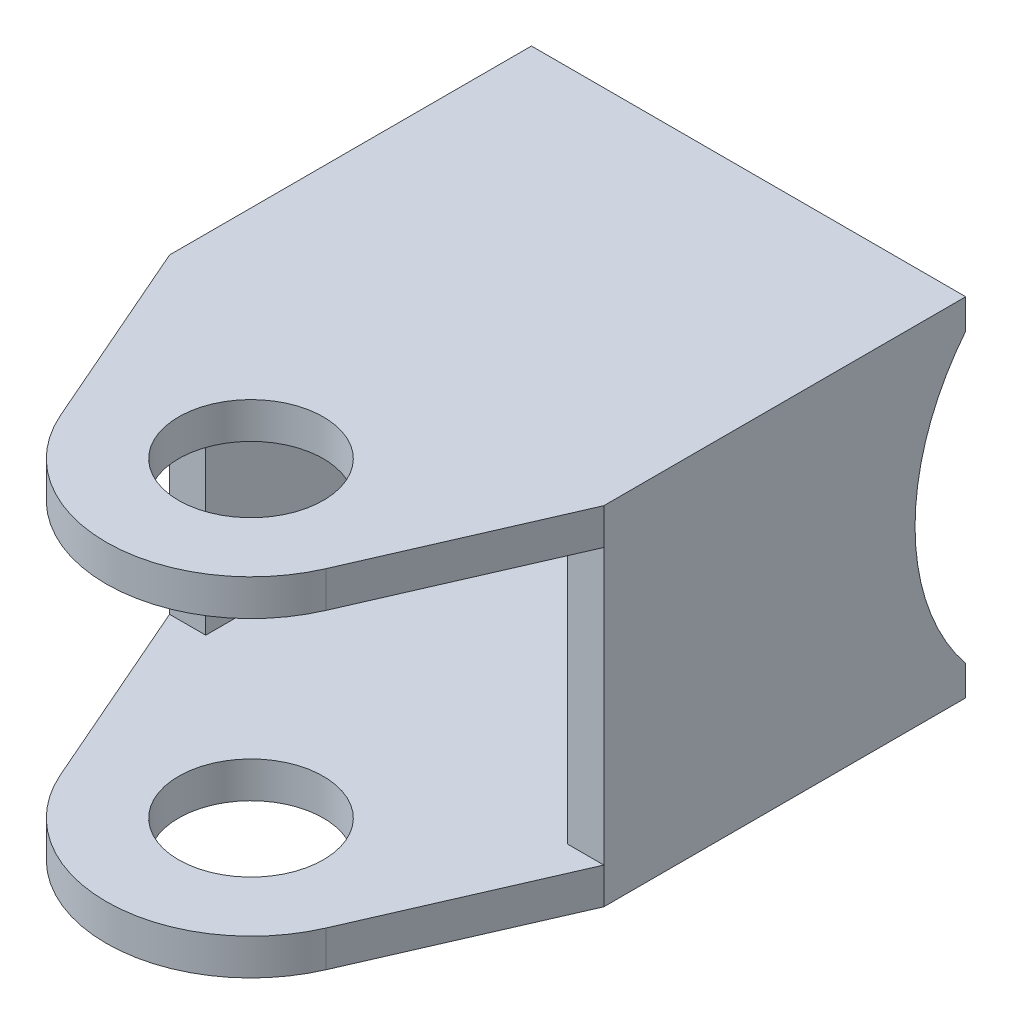
ISO-10303-21;
HEADER;
FILE_DESCRIPTION(('STEP AP214'),'2;1');
FILE_NAME('part.step','',(''),(''),'','','');
FILE_SCHEMA(('AUTOMOTIVE_DESIGN { 1 0 10303 214 1 1 1 1 }'));
ENDSEC;
DATA;
#1=APPLICATION_CONTEXT('core data for automotive mechanical design processes');
#2=APPLICATION_PROTOCOL_DEFINITION('international standard','automotive_design',2000,#1);
#3=PRODUCT_CONTEXT('',#1,'mechanical');
#4=PRODUCT('Part','Part','',(#3));
#5=PRODUCT_RELATED_PRODUCT_CATEGORY('part','',(#4));
#6=PRODUCT_DEFINITION_FORMATION('','',#4);
#7=PRODUCT_DEFINITION_CONTEXT('part definition',#1,'design');
#8=PRODUCT_DEFINITION('design','',#6,#7);
#9=PRODUCT_DEFINITION_SHAPE('','',#8);
#10=(LENGTH_UNIT() NAMED_UNIT(*) SI_UNIT(.MILLI.,.METRE.));
#11=(NAMED_UNIT(*) PLANE_ANGLE_UNIT() SI_UNIT($,.RADIAN.));
#12=(NAMED_UNIT(*) SI_UNIT($,.STERADIAN.) SOLID_ANGLE_UNIT());
#13=UNCERTAINTY_MEASURE_WITH_UNIT(LENGTH_MEASURE(1.E-05),#10,'distance_accuracy_value','');
#14=(GEOMETRIC_REPRESENTATION_CONTEXT(3) GLOBAL_UNCERTAINTY_ASSIGNED_CONTEXT((#13)) GLOBAL_UNIT_ASSIGNED_CONTEXT((#10,
#11,#12)) REPRESENTATION_CONTEXT('',''));
#15=CARTESIAN_POINT('',(0.,0.,0.));
#16=DIRECTION('',(0.,0.,1.));
#17=DIRECTION('',(1.,0.,0.));
#18=AXIS2_PLACEMENT_3D('',#15,#16,#17);
#19=CARTESIAN_POINT('',(0.,7.6,0.));
#20=DIRECTION('',(0.,-1.,0.));
#21=DIRECTION('',(0.,0.,-1.));
#22=AXIS2_PLACEMENT_3D('',#19,#20,#21);
#23=PLANE('',#22);
#24=CARTESIAN_POINT('',(0.,7.6,0.));
#25=DIRECTION('',(0.,1.,0.));
#26=DIRECTION('',(0.,0.,1.));
#27=AXIS2_PLACEMENT_3D('',#24,#25,#26);
#28=CIRCLE('',#27,4.);
#29=CARTESIAN_POINT('',(0.,7.6,4.));
#30=VERTEX_POINT('',#29);
#31=EDGE_CURVE('E185',#30,#30,#28,.T.);
#32=ORIENTED_EDGE('',*,*,#31,.T.);
#33=EDGE_LOOP('',(#32));
#34=FACE_BOUND('',#33,.T.);
#35=DIRECTION('',(0.,0.,1.));
#36=VECTOR('',#35,1.);
#37=CARTESIAN_POINT('',(-10.,7.6,-27.5));
#38=LINE('',#37,#36);
#39=CARTESIAN_POINT('',(-10.,7.6,-27.2250307125771));
#40=VERTEX_POINT('',#39);
#41=CARTESIAN_POINT('',(-10.,7.6,-7.5));
#42=VERTEX_POINT('',#41);
#43=EDGE_CURVE('E38',#40,#42,#38,.T.);
#44=ORIENTED_EDGE('',*,*,#43,.F.);
#45=DIRECTION('',(-1.,0.,0.));
#46=VECTOR('',#45,1.);
#47=CARTESIAN_POINT('',(12.,7.6,-27.2250307125771));
#48=LINE('',#47,#46);
#49=CARTESIAN_POINT('',(10.,7.6,-27.2250307125771));
#50=VERTEX_POINT('',#49);
#51=EDGE_CURVE('E379',#40,#50,#48,.F.);
#52=ORIENTED_EDGE('',*,*,#51,.T.);
#53=DIRECTION('',(0.,0.,-1.));
#54=VECTOR('',#53,1.);
#55=CARTESIAN_POINT('',(10.,7.6,-27.5));
#56=LINE('',#55,#54);
#57=CARTESIAN_POINT('',(10.,7.6,-7.5));
#58=VERTEX_POINT('',#57);
#59=EDGE_CURVE('E256',#58,#50,#56,.T.);
#60=ORIENTED_EDGE('',*,*,#59,.F.);
#61=DIRECTION('',(-1.,0.,0.));
#62=VECTOR('',#61,1.);
#63=CARTESIAN_POINT('',(12.,7.6,-7.5));
#64=LINE('',#63,#62);
#65=CARTESIAN_POINT('',(12.,7.6,-7.5));
#66=VERTEX_POINT('',#65);
#67=EDGE_CURVE('E253',#66,#58,#64,.T.);
#68=ORIENTED_EDGE('',*,*,#67,.F.);
#69=DIRECTION('',(0.399857230257902,0.,-0.916577435577856));
#70=VECTOR('',#69,1.);
#71=CARTESIAN_POINT('',(12.,7.6,-7.5));
#72=LINE('',#71,#70);
#73=CARTESIAN_POINT('',(7.33261948462285,7.6,3.19885784206322));
#74=VERTEX_POINT('',#73);
#75=EDGE_CURVE('E199',#74,#66,#72,.T.);
#76=ORIENTED_EDGE('',*,*,#75,.F.);
#77=CARTESIAN_POINT('',(0.,7.6,0.));
#78=DIRECTION('',(0.,1.,0.));
#79=DIRECTION('',(0.,0.,-1.));
#80=AXIS2_PLACEMENT_3D('',#77,#78,#79);
#81=CIRCLE('',#80,8.);
#82=CARTESIAN_POINT('',(-7.33261948462285,7.6,3.19885784206322));
#83=VERTEX_POINT('',#82);
#84=EDGE_CURVE('E211',#83,#74,#81,.T.);
#85=ORIENTED_EDGE('',*,*,#84,.F.);
#86=DIRECTION('',(0.399857230257903,0.,0.916577435577856));
#87=VECTOR('',#86,1.);
#88=CARTESIAN_POINT('',(-12.,7.6,-7.5));
#89=LINE('',#88,#87);
#90=CARTESIAN_POINT('',(-12.,7.6,-7.5));
#91=VERTEX_POINT('',#90);
#92=EDGE_CURVE('E194',#91,#83,#89,.T.);
#93=ORIENTED_EDGE('',*,*,#92,.F.);
#94=DIRECTION('',(-1.,0.,0.));
#95=VECTOR('',#94,1.);
#96=CARTESIAN_POINT('',(-12.,7.6,-7.5));
#97=LINE('',#96,#95);
#98=EDGE_CURVE('E182',#42,#91,#97,.T.);
#99=ORIENTED_EDGE('',*,*,#98,.F.);
#100=EDGE_LOOP('',(#44,#52,#60,#68,#76,#85,#93,#99));
#101=FACE_BOUND('',#100,.T.);
#102=ADVANCED_FACE('F34',(#34,#101),#23,.T.);
#103=CARTESIAN_POINT('',(0.,-7.6,0.));
#104=DIRECTION('',(0.,-1.,0.));
#105=DIRECTION('',(0.,0.,-1.));
#106=AXIS2_PLACEMENT_3D('',#103,#104,#105);
#107=PLANE('',#106);
#108=CARTESIAN_POINT('',(0.,-7.6,0.));
#109=DIRECTION('',(0.,1.,0.));
#110=DIRECTION('',(0.,0.,1.));
#111=AXIS2_PLACEMENT_3D('',#108,#109,#110);
#112=CIRCLE('',#111,4.);
#113=CARTESIAN_POINT('',(0.,-7.6,4.));
#114=VERTEX_POINT('',#113);
#115=EDGE_CURVE('E261',#114,#114,#112,.T.);
#116=ORIENTED_EDGE('',*,*,#115,.F.);
#117=EDGE_LOOP('',(#116));
#118=FACE_BOUND('',#117,.T.);
#119=DIRECTION('',(-1.,0.,0.));
#120=VECTOR('',#119,1.);
#121=CARTESIAN_POINT('',(12.,-7.6,-27.2250307125771));
#122=LINE('',#121,#120);
#123=CARTESIAN_POINT('',(-10.,-7.6,-27.2250307125771));
#124=VERTEX_POINT('',#123);
#125=CARTESIAN_POINT('',(10.,-7.6,-27.2250307125771));
#126=VERTEX_POINT('',#125);
#127=EDGE_CURVE('E58',#124,#126,#122,.F.);
#128=ORIENTED_EDGE('',*,*,#127,.F.);
#129=DIRECTION('',(0.,0.,-1.));
#130=VECTOR('',#129,1.);
#131=CARTESIAN_POINT('',(-10.,-7.6,-27.5));
#132=LINE('',#131,#130);
#133=CARTESIAN_POINT('',(-10.,-7.6,-7.5));
#134=VERTEX_POINT('',#133);
#135=EDGE_CURVE('E173',#134,#124,#132,.T.);
#136=ORIENTED_EDGE('',*,*,#135,.F.);
#137=DIRECTION('',(1.,0.,0.));
#138=VECTOR('',#137,1.);
#139=CARTESIAN_POINT('',(-12.,-7.6,-7.5));
#140=LINE('',#139,#138);
#141=CARTESIAN_POINT('',(-12.,-7.6,-7.5));
#142=VERTEX_POINT('',#141);
#143=EDGE_CURVE('E177',#142,#134,#140,.T.);
#144=ORIENTED_EDGE('',*,*,#143,.F.);
#145=DIRECTION('',(0.399857230257903,0.,0.916577435577856));
#146=VECTOR('',#145,1.);
#147=CARTESIAN_POINT('',(-12.,-7.6,-7.5));
#148=LINE('',#147,#146);
#149=CARTESIAN_POINT('',(-7.33261948462285,-7.6,3.19885784206322));
#150=VERTEX_POINT('',#149);
#151=EDGE_CURVE('E269',#142,#150,#148,.T.);
#152=ORIENTED_EDGE('',*,*,#151,.T.);
#153=CARTESIAN_POINT('',(0.,-7.6,0.));
#154=DIRECTION('',(0.,1.,0.));
#155=DIRECTION('',(0.,0.,-1.));
#156=AXIS2_PLACEMENT_3D('',#153,#154,#155);
#157=CIRCLE('',#156,8.);
#158=CARTESIAN_POINT('',(7.33261948462285,-7.6,3.19885784206322));
#159=VERTEX_POINT('',#158);
#160=EDGE_CURVE('E291',#150,#159,#157,.T.);
#161=ORIENTED_EDGE('',*,*,#160,.T.);
#162=DIRECTION('',(0.399857230257902,0.,-0.916577435577856));
#163=VECTOR('',#162,1.);
#164=CARTESIAN_POINT('',(12.,-7.6,-7.5));
#165=LINE('',#164,#163);
#166=CARTESIAN_POINT('',(12.,-7.6,-7.5));
#167=VERTEX_POINT('',#166);
#168=EDGE_CURVE('E275',#159,#167,#165,.T.);
#169=ORIENTED_EDGE('',*,*,#168,.T.);
#170=DIRECTION('',(1.,0.,0.));
#171=VECTOR('',#170,1.);
#172=CARTESIAN_POINT('',(12.,-7.6,-7.5));
#173=LINE('',#172,#171);
#174=CARTESIAN_POINT('',(10.,-7.6,-7.5));
#175=VERTEX_POINT('',#174);
#176=EDGE_CURVE('E388',#175,#167,#173,.T.);
#177=ORIENTED_EDGE('',*,*,#176,.F.);
#178=DIRECTION('',(0.,0.,1.));
#179=VECTOR('',#178,1.);
#180=CARTESIAN_POINT('',(10.,-7.6,-27.5));
#181=LINE('',#180,#179);
#182=EDGE_CURVE('E155',#126,#175,#181,.T.);
#183=ORIENTED_EDGE('',*,*,#182,.F.);
#184=EDGE_LOOP('',(#128,#136,#144,#152,#161,#169,#177,#183));
#185=FACE_BOUND('',#184,.T.);
#186=ADVANCED_FACE('F329',(#118,#185),#107,.F.);
#187=CARTESIAN_POINT('',(12.,9.6,-27.5));
#188=DIRECTION('',(-1.,0.,0.));
#189=DIRECTION('',(0.,0.,1.));
#190=AXIS2_PLACEMENT_3D('',#187,#188,#189);
#191=PLANE('',#190);
#192=CARTESIAN_POINT('',(12.,0.,-37.4));
#193=DIRECTION('',(1.,0.,0.));
#194=DIRECTION('',(0.,0.,-1.));
#195=AXIS2_PLACEMENT_3D('',#192,#193,#194);
#196=CIRCLE('',#195,12.7);
#197=CARTESIAN_POINT('',(12.,7.95487272054054,-27.5));
#198=VERTEX_POINT('',#197);
#199=CARTESIAN_POINT('',(12.,-7.95487272054054,-27.5));
#200=VERTEX_POINT('',#199);
#201=EDGE_CURVE('E149',#198,#200,#196,.T.);
#202=ORIENTED_EDGE('',*,*,#201,.F.);
#203=DIRECTION('',(0.,-1.,0.));
#204=VECTOR('',#203,1.);
#205=CARTESIAN_POINT('',(12.,9.6,-27.5));
#206=LINE('',#205,#204);
#207=CARTESIAN_POINT('',(12.,9.6,-27.5));
#208=VERTEX_POINT('',#207);
#209=EDGE_CURVE('E44',#208,#198,#206,.T.);
#210=ORIENTED_EDGE('',*,*,#209,.F.);
#211=DIRECTION('',(0.,0.,-1.));
#212=VECTOR('',#211,1.);
#213=CARTESIAN_POINT('',(12.,9.6,-27.5));
#214=LINE('',#213,#212);
#215=CARTESIAN_POINT('',(12.,9.6,-7.5));
#216=VERTEX_POINT('',#215);
#217=EDGE_CURVE('E197',#216,#208,#214,.T.);
#218=ORIENTED_EDGE('',*,*,#217,.F.);
#219=DIRECTION('',(0.,-1.,0.));
#220=VECTOR('',#219,1.);
#221=CARTESIAN_POINT('',(12.,9.6,-7.5));
#222=LINE('',#221,#220);
#223=EDGE_CURVE('E209',#216,#66,#222,.T.);
#224=ORIENTED_EDGE('',*,*,#223,.T.);
#225=DIRECTION('',(0.,-1.,0.));
#226=VECTOR('',#225,1.);
#227=CARTESIAN_POINT('',(12.,27.6997512422418,-7.5));
#228=LINE('',#227,#226);
#229=EDGE_CURVE('E241',#66,#167,#228,.T.);
#230=ORIENTED_EDGE('',*,*,#229,.T.);
#231=DIRECTION('',(0.,1.,0.));
#232=VECTOR('',#231,1.);
#233=CARTESIAN_POINT('',(12.,-9.6,-7.5));
#234=LINE('',#233,#232);
#235=CARTESIAN_POINT('',(12.,-9.6,-7.5));
#236=VERTEX_POINT('',#235);
#237=EDGE_CURVE('E296',#236,#167,#234,.T.);
#238=ORIENTED_EDGE('',*,*,#237,.F.);
#239=DIRECTION('',(0.,0.,-1.));
#240=VECTOR('',#239,1.);
#241=CARTESIAN_POINT('',(12.,-9.6,-27.5));
#242=LINE('',#241,#240);
#243=CARTESIAN_POINT('',(12.,-9.6,-27.5));
#244=VERTEX_POINT('',#243);
#245=EDGE_CURVE('E272',#236,#244,#242,.T.);
#246=ORIENTED_EDGE('',*,*,#245,.T.);
#247=EDGE_CURVE('E162',#200,#244,#206,.T.);
#248=ORIENTED_EDGE('',*,*,#247,.F.);
#249=EDGE_LOOP('',(#202,#210,#218,#224,#230,#238,#246,#248));
#250=FACE_BOUND('',#249,.T.);
#251=ADVANCED_FACE('F36',(#250),#191,.F.);
#252=CARTESIAN_POINT('',(7.06,9.6,-27.5));
#253=DIRECTION('',(0.,0.,1.));
#254=DIRECTION('',(1.,0.,0.));
#255=AXIS2_PLACEMENT_3D('',#252,#253,#254);
#256=PLANE('',#255);
#257=DIRECTION('',(-1.,0.,0.));
#258=VECTOR('',#257,1.);
#259=CARTESIAN_POINT('',(12.,7.95487272054054,-27.5));
#260=LINE('',#259,#258);
#261=CARTESIAN_POINT('',(-12.,7.95487272054054,-27.5));
#262=VERTEX_POINT('',#261);
#263=EDGE_CURVE('E146',#262,#198,#260,.F.);
#264=ORIENTED_EDGE('',*,*,#263,.F.);
#265=DIRECTION('',(0.,-1.,0.));
#266=VECTOR('',#265,1.);
#267=CARTESIAN_POINT('',(-12.,9.6,-27.5));
#268=LINE('',#267,#266);
#269=CARTESIAN_POINT('',(-12.,9.6,-27.5));
#270=VERTEX_POINT('',#269);
#271=EDGE_CURVE('E168',#270,#262,#268,.T.);
#272=ORIENTED_EDGE('',*,*,#271,.F.);
#273=DIRECTION('',(-1.,0.,0.));
#274=VECTOR('',#273,1.);
#275=CARTESIAN_POINT('',(7.06,9.6,-27.5));
#276=LINE('',#275,#274);
#277=EDGE_CURVE('E165',#208,#270,#276,.T.);
#278=ORIENTED_EDGE('',*,*,#277,.F.);
#279=ORIENTED_EDGE('',*,*,#209,.T.);
#280=EDGE_LOOP('',(#264,#272,#278,#279));
#281=FACE_BOUND('',#280,.T.);
#282=ADVANCED_FACE('F164',(#281),#256,.F.);
#283=DIRECTION('',(-1.,0.,0.));
#284=VECTOR('',#283,1.);
#285=CARTESIAN_POINT('',(12.,-7.95487272054054,-27.5));
#286=LINE('',#285,#284);
#287=CARTESIAN_POINT('',(-12.,-7.95487272054054,-27.5));
#288=VERTEX_POINT('',#287);
#289=EDGE_CURVE('E51',#200,#288,#286,.T.);
#290=ORIENTED_EDGE('',*,*,#289,.F.);
#291=ORIENTED_EDGE('',*,*,#247,.T.);
#292=DIRECTION('',(-1.,0.,0.));
#293=VECTOR('',#292,1.);
#294=CARTESIAN_POINT('',(7.06,-9.6,-27.5));
#295=LINE('',#294,#293);
#296=CARTESIAN_POINT('',(-12.,-9.6,-27.5));
#297=VERTEX_POINT('',#296);
#298=EDGE_CURVE('E274',#244,#297,#295,.T.);
#299=ORIENTED_EDGE('',*,*,#298,.T.);
#300=EDGE_CURVE('E223',#288,#297,#268,.T.);
#301=ORIENTED_EDGE('',*,*,#300,.F.);
#302=EDGE_LOOP('',(#290,#291,#299,#301));
#303=FACE_BOUND('',#302,.T.);
#304=ADVANCED_FACE('F397',(#303),#256,.F.);
#305=CARTESIAN_POINT('',(-12.,9.6,-22.8889007140539));
#306=DIRECTION('',(1.,0.,0.));
#307=DIRECTION('',(0.,0.,-1.));
#308=AXIS2_PLACEMENT_3D('',#305,#306,#307);
#309=PLANE('',#308);
#310=CARTESIAN_POINT('',(-12.,0.,-37.4));
#311=DIRECTION('',(1.,0.,0.));
#312=DIRECTION('',(0.,0.,-1.));
#313=AXIS2_PLACEMENT_3D('',#310,#311,#312);
#314=CIRCLE('',#313,12.7);
#315=EDGE_CURVE('E150',#262,#288,#314,.T.);
#316=ORIENTED_EDGE('',*,*,#315,.T.);
#317=ORIENTED_EDGE('',*,*,#300,.T.);
#318=DIRECTION('',(0.,0.,1.));
#319=VECTOR('',#318,1.);
#320=CARTESIAN_POINT('',(-12.,-9.6,-27.5));
#321=LINE('',#320,#319);
#322=CARTESIAN_POINT('',(-12.,-9.6,-7.5));
#323=VERTEX_POINT('',#322);
#324=EDGE_CURVE('E277',#297,#323,#321,.T.);
#325=ORIENTED_EDGE('',*,*,#324,.T.);
#326=DIRECTION('',(0.,1.,0.));
#327=VECTOR('',#326,1.);
#328=CARTESIAN_POINT('',(-12.,-9.6,-7.5));
#329=LINE('',#328,#327);
#330=EDGE_CURVE('E288',#323,#142,#329,.T.);
#331=ORIENTED_EDGE('',*,*,#330,.T.);
#332=DIRECTION('',(0.,-1.,0.));
#333=VECTOR('',#332,1.);
#334=CARTESIAN_POINT('',(-12.,27.6997512422418,-7.5));
#335=LINE('',#334,#333);
#336=EDGE_CURVE('E188',#91,#142,#335,.T.);
#337=ORIENTED_EDGE('',*,*,#336,.F.);
#338=DIRECTION('',(0.,-1.,0.));
#339=VECTOR('',#338,1.);
#340=CARTESIAN_POINT('',(-12.,9.6,-7.5));
#341=LINE('',#340,#339);
#342=CARTESIAN_POINT('',(-12.,9.6,-7.5));
#343=VERTEX_POINT('',#342);
#344=EDGE_CURVE('E222',#343,#91,#341,.T.);
#345=ORIENTED_EDGE('',*,*,#344,.F.);
#346=DIRECTION('',(0.,0.,1.));
#347=VECTOR('',#346,1.);
#348=CARTESIAN_POINT('',(-12.,9.6,-27.5));
#349=LINE('',#348,#347);
#350=EDGE_CURVE('E201',#270,#343,#349,.T.);
#351=ORIENTED_EDGE('',*,*,#350,.F.);
#352=ORIENTED_EDGE('',*,*,#271,.T.);
#353=EDGE_LOOP('',(#316,#317,#325,#331,#337,#345,#351,#352));
#354=FACE_BOUND('',#353,.T.);
#355=ADVANCED_FACE('F232',(#354),#309,.F.);
#356=CARTESIAN_POINT('',(-10.,27.6997512422418,-27.5));
#357=DIRECTION('',(-1.,0.,0.));
#358=DIRECTION('',(0.,0.,1.));
#359=AXIS2_PLACEMENT_3D('',#356,#357,#358);
#360=PLANE('',#359);
#361=CARTESIAN_POINT('',(-10.,0.,-37.4));
#362=DIRECTION('',(-1.,0.,0.));
#363=DIRECTION('',(0.,0.,1.));
#364=AXIS2_PLACEMENT_3D('',#361,#362,#363);
#365=CIRCLE('',#364,12.7);
#366=EDGE_CURVE('E378',#40,#124,#365,.F.);
#367=ORIENTED_EDGE('',*,*,#366,.F.);
#368=ORIENTED_EDGE('',*,*,#43,.T.);
#369=DIRECTION('',(0.,-1.,0.));
#370=VECTOR('',#369,1.);
#371=CARTESIAN_POINT('',(-10.,27.6997512422418,-7.5));
#372=LINE('',#371,#370);
#373=EDGE_CURVE('E176',#42,#134,#372,.T.);
#374=ORIENTED_EDGE('',*,*,#373,.T.);
#375=ORIENTED_EDGE('',*,*,#135,.T.);
#376=EDGE_LOOP('',(#367,#368,#374,#375));
#377=FACE_BOUND('',#376,.T.);
#378=ADVANCED_FACE('F347',(#377),#360,.F.);
#379=CARTESIAN_POINT('',(10.,27.6997512422418,-27.5));
#380=DIRECTION('',(1.,0.,0.));
#381=DIRECTION('',(0.,0.,-1.));
#382=AXIS2_PLACEMENT_3D('',#379,#380,#381);
#383=PLANE('',#382);
#384=CARTESIAN_POINT('',(10.,0.,-37.4));
#385=DIRECTION('',(1.,0.,0.));
#386=DIRECTION('',(0.,0.,-1.));
#387=AXIS2_PLACEMENT_3D('',#384,#385,#386);
#388=CIRCLE('',#387,12.7);
#389=EDGE_CURVE('E11',#126,#50,#388,.F.);
#390=ORIENTED_EDGE('',*,*,#389,.F.);
#391=ORIENTED_EDGE('',*,*,#182,.T.);
#392=DIRECTION('',(0.,-1.,0.));
#393=VECTOR('',#392,1.);
#394=CARTESIAN_POINT('',(10.,27.6997512422418,-7.5));
#395=LINE('',#394,#393);
#396=EDGE_CURVE('E259',#58,#175,#395,.T.);
#397=ORIENTED_EDGE('',*,*,#396,.F.);
#398=ORIENTED_EDGE('',*,*,#59,.T.);
#399=EDGE_LOOP('',(#390,#391,#397,#398));
#400=FACE_BOUND('',#399,.T.);
#401=ADVANCED_FACE('F340',(#400),#383,.F.);
#402=CARTESIAN_POINT('',(0.,9.6,0.));
#403=DIRECTION('',(0.,-1.,0.));
#404=DIRECTION('',(0.,0.,-1.));
#405=AXIS2_PLACEMENT_3D('',#402,#403,#404);
#406=PLANE('',#405);
#407=ORIENTED_EDGE('',*,*,#217,.T.);
#408=ORIENTED_EDGE('',*,*,#277,.T.);
#409=ORIENTED_EDGE('',*,*,#350,.T.);
#410=DIRECTION('',(0.399857230257903,0.,0.916577435577856));
#411=VECTOR('',#410,1.);
#412=CARTESIAN_POINT('',(-12.,9.6,-7.5));
#413=LINE('',#412,#411);
#414=CARTESIAN_POINT('',(-7.33261948462285,9.6,3.19885784206322));
#415=VERTEX_POINT('',#414);
#416=EDGE_CURVE('E203',#343,#415,#413,.T.);
#417=ORIENTED_EDGE('',*,*,#416,.T.);
#418=CARTESIAN_POINT('',(0.,9.6,0.));
#419=DIRECTION('',(0.,1.,0.));
#420=DIRECTION('',(0.,0.,-1.));
#421=AXIS2_PLACEMENT_3D('',#418,#419,#420);
#422=CIRCLE('',#421,8.);
#423=CARTESIAN_POINT('',(7.33261948462285,9.6,3.19885784206322));
#424=VERTEX_POINT('',#423);
#425=EDGE_CURVE('E205',#415,#424,#422,.T.);
#426=ORIENTED_EDGE('',*,*,#425,.T.);
#427=DIRECTION('',(0.399857230257902,0.,-0.916577435577856));
#428=VECTOR('',#427,1.);
#429=CARTESIAN_POINT('',(12.,9.6,-7.5));
#430=LINE('',#429,#428);
#431=EDGE_CURVE('E207',#424,#216,#430,.T.);
#432=ORIENTED_EDGE('',*,*,#431,.T.);
#433=EDGE_LOOP('',(#407,#408,#409,#417,#426,#432));
#434=FACE_BOUND('',#433,.T.);
#435=CARTESIAN_POINT('',(0.,9.6,0.));
#436=DIRECTION('',(0.,1.,0.));
#437=DIRECTION('',(0.,0.,1.));
#438=AXIS2_PLACEMENT_3D('',#435,#436,#437);
#439=CIRCLE('',#438,4.);
#440=CARTESIAN_POINT('',(0.,9.6,4.));
#441=VERTEX_POINT('',#440);
#442=EDGE_CURVE('E191',#441,#441,#439,.T.);
#443=ORIENTED_EDGE('',*,*,#442,.F.);
#444=EDGE_LOOP('',(#443));
#445=FACE_BOUND('',#444,.T.);
#446=ADVANCED_FACE('F235',(#434,#445),#406,.F.);
#447=CARTESIAN_POINT('',(-12.,9.6,-7.5));
#448=DIRECTION('',(0.916577435577856,0.,-0.399857230257903));
#449=DIRECTION('',(-0.399857230257903,0.,-0.916577435577856));
#450=AXIS2_PLACEMENT_3D('',#447,#448,#449);
#451=PLANE('',#450);
#452=ORIENTED_EDGE('',*,*,#92,.T.);
#453=DIRECTION('',(0.,-1.,0.));
#454=VECTOR('',#453,1.);
#455=CARTESIAN_POINT('',(-7.33261948462285,9.6,3.19885784206322));
#456=LINE('',#455,#454);
#457=EDGE_CURVE('E220',#415,#83,#456,.T.);
#458=ORIENTED_EDGE('',*,*,#457,.F.);
#459=ORIENTED_EDGE('',*,*,#416,.F.);
#460=ORIENTED_EDGE('',*,*,#344,.T.);
#461=EDGE_LOOP('',(#452,#458,#459,#460));
#462=FACE_BOUND('',#461,.T.);
#463=ADVANCED_FACE('F315',(#462),#451,.F.);
#464=CARTESIAN_POINT('',(0.,9.6,0.));
#465=DIRECTION('',(0.,-1.,0.));
#466=DIRECTION('',(0.,0.,-1.));
#467=AXIS2_PLACEMENT_3D('',#464,#465,#466);
#468=CYLINDRICAL_SURFACE('',#467,8.);
#469=ORIENTED_EDGE('',*,*,#84,.T.);
#470=DIRECTION('',(0.,-1.,0.));
#471=VECTOR('',#470,1.);
#472=CARTESIAN_POINT('',(7.33261948462285,9.6,3.19885784206322));
#473=LINE('',#472,#471);
#474=EDGE_CURVE('E217',#424,#74,#473,.T.);
#475=ORIENTED_EDGE('',*,*,#474,.F.);
#476=ORIENTED_EDGE('',*,*,#425,.F.);
#477=ORIENTED_EDGE('',*,*,#457,.T.);
#478=EDGE_LOOP('',(#469,#475,#476,#477));
#479=FACE_BOUND('',#478,.T.);
#480=ADVANCED_FACE('F318',(#479),#468,.T.);
#481=CARTESIAN_POINT('',(12.,9.6,-7.5));
#482=DIRECTION('',(-0.916577435577856,0.,-0.399857230257902));
#483=DIRECTION('',(-0.399857230257902,0.,0.916577435577856));
#484=AXIS2_PLACEMENT_3D('',#481,#482,#483);
#485=PLANE('',#484);
#486=ORIENTED_EDGE('',*,*,#75,.T.);
#487=ORIENTED_EDGE('',*,*,#223,.F.);
#488=ORIENTED_EDGE('',*,*,#431,.F.);
#489=ORIENTED_EDGE('',*,*,#474,.T.);
#490=EDGE_LOOP('',(#486,#487,#488,#489));
#491=FACE_BOUND('',#490,.T.);
#492=ADVANCED_FACE('F244',(#491),#485,.F.);
#493=CARTESIAN_POINT('',(0.,9.6,0.));
#494=DIRECTION('',(0.,-1.,0.));
#495=DIRECTION('',(0.,0.,-1.));
#496=AXIS2_PLACEMENT_3D('',#493,#494,#495);
#497=CYLINDRICAL_SURFACE('',#496,4.);
#498=ORIENTED_EDGE('',*,*,#442,.T.);
#499=EDGE_LOOP('',(#498));
#500=FACE_BOUND('',#499,.T.);
#501=ORIENTED_EDGE('',*,*,#31,.F.);
#502=EDGE_LOOP('',(#501));
#503=FACE_BOUND('',#502,.T.);
#504=ADVANCED_FACE('F325',(#500,#503),#497,.F.);
#505=CARTESIAN_POINT('',(-12.,27.6997512422418,-7.5));
#506=DIRECTION('',(0.,0.,-1.));
#507=DIRECTION('',(-1.,0.,0.));
#508=AXIS2_PLACEMENT_3D('',#505,#506,#507);
#509=PLANE('',#508);
#510=ORIENTED_EDGE('',*,*,#373,.F.);
#511=ORIENTED_EDGE('',*,*,#98,.T.);
#512=ORIENTED_EDGE('',*,*,#336,.T.);
#513=ORIENTED_EDGE('',*,*,#143,.T.);
#514=EDGE_LOOP('',(#510,#511,#512,#513));
#515=FACE_BOUND('',#514,.T.);
#516=ADVANCED_FACE('F313',(#515),#509,.F.);
#517=CARTESIAN_POINT('',(12.,-9.6,-7.5));
#518=DIRECTION('',(0.916577435577856,0.,0.399857230257902));
#519=DIRECTION('',(0.399857230257902,0.,-0.916577435577856));
#520=AXIS2_PLACEMENT_3D('',#517,#518,#519);
#521=PLANE('',#520);
#522=ORIENTED_EDGE('',*,*,#168,.F.);
#523=DIRECTION('',(0.,1.,0.));
#524=VECTOR('',#523,1.);
#525=CARTESIAN_POINT('',(7.33261948462285,-9.6,3.19885784206322));
#526=LINE('',#525,#524);
#527=CARTESIAN_POINT('',(7.33261948462285,-9.6,3.19885784206322));
#528=VERTEX_POINT('',#527);
#529=EDGE_CURVE('E298',#528,#159,#526,.T.);
#530=ORIENTED_EDGE('',*,*,#529,.F.);
#531=DIRECTION('',(0.399857230257902,0.,-0.916577435577856));
#532=VECTOR('',#531,1.);
#533=CARTESIAN_POINT('',(12.,-9.6,-7.5));
#534=LINE('',#533,#532);
#535=EDGE_CURVE('E285',#528,#236,#534,.T.);
#536=ORIENTED_EDGE('',*,*,#535,.T.);
#537=ORIENTED_EDGE('',*,*,#237,.T.);
#538=EDGE_LOOP('',(#522,#530,#536,#537));
#539=FACE_BOUND('',#538,.T.);
#540=ADVANCED_FACE('F346',(#539),#521,.T.);
#541=CARTESIAN_POINT('',(0.,-9.6,0.));
#542=DIRECTION('',(0.,1.,0.));
#543=DIRECTION('',(0.,0.,1.));
#544=AXIS2_PLACEMENT_3D('',#541,#542,#543);
#545=CYLINDRICAL_SURFACE('',#544,8.);
#546=ORIENTED_EDGE('',*,*,#160,.F.);
#547=DIRECTION('',(0.,1.,0.));
#548=VECTOR('',#547,1.);
#549=CARTESIAN_POINT('',(-7.33261948462285,-9.6,3.19885784206322));
#550=LINE('',#549,#548);
#551=CARTESIAN_POINT('',(-7.33261948462285,-9.6,3.19885784206322));
#552=VERTEX_POINT('',#551);
#553=EDGE_CURVE('E300',#552,#150,#550,.T.);
#554=ORIENTED_EDGE('',*,*,#553,.F.);
#555=CARTESIAN_POINT('',(0.,-9.6,0.));
#556=DIRECTION('',(0.,1.,0.));
#557=DIRECTION('',(0.,0.,-1.));
#558=AXIS2_PLACEMENT_3D('',#555,#556,#557);
#559=CIRCLE('',#558,8.);
#560=EDGE_CURVE('E282',#552,#528,#559,.T.);
#561=ORIENTED_EDGE('',*,*,#560,.T.);
#562=ORIENTED_EDGE('',*,*,#529,.T.);
#563=EDGE_LOOP('',(#546,#554,#561,#562));
#564=FACE_BOUND('',#563,.T.);
#565=ADVANCED_FACE('F354',(#564),#545,.T.);
#566=CARTESIAN_POINT('',(-12.,-9.6,-7.5));
#567=DIRECTION('',(-0.916577435577856,0.,0.399857230257903));
#568=DIRECTION('',(0.399857230257903,0.,0.916577435577856));
#569=AXIS2_PLACEMENT_3D('',#566,#567,#568);
#570=PLANE('',#569);
#571=ORIENTED_EDGE('',*,*,#151,.F.);
#572=ORIENTED_EDGE('',*,*,#330,.F.);
#573=DIRECTION('',(0.399857230257903,0.,0.916577435577856));
#574=VECTOR('',#573,1.);
#575=CARTESIAN_POINT('',(-12.,-9.6,-7.5));
#576=LINE('',#575,#574);
#577=EDGE_CURVE('E279',#323,#552,#576,.T.);
#578=ORIENTED_EDGE('',*,*,#577,.T.);
#579=ORIENTED_EDGE('',*,*,#553,.T.);
#580=EDGE_LOOP('',(#571,#572,#578,#579));
#581=FACE_BOUND('',#580,.T.);
#582=ADVANCED_FACE('F307',(#581),#570,.T.);
#583=CARTESIAN_POINT('',(0.,-9.6,0.));
#584=DIRECTION('',(0.,-1.,0.));
#585=DIRECTION('',(0.,0.,-1.));
#586=AXIS2_PLACEMENT_3D('',#583,#584,#585);
#587=PLANE('',#586);
#588=CARTESIAN_POINT('',(0.,-9.6,0.));
#589=DIRECTION('',(0.,1.,0.));
#590=DIRECTION('',(0.,0.,1.));
#591=AXIS2_PLACEMENT_3D('',#588,#589,#590);
#592=CIRCLE('',#591,4.);
#593=CARTESIAN_POINT('',(0.,-9.6,4.));
#594=VERTEX_POINT('',#593);
#595=EDGE_CURVE('E266',#594,#594,#592,.T.);
#596=ORIENTED_EDGE('',*,*,#595,.T.);
#597=EDGE_LOOP('',(#596));
#598=FACE_BOUND('',#597,.T.);
#599=ORIENTED_EDGE('',*,*,#245,.F.);
#600=ORIENTED_EDGE('',*,*,#535,.F.);
#601=ORIENTED_EDGE('',*,*,#560,.F.);
#602=ORIENTED_EDGE('',*,*,#577,.F.);
#603=ORIENTED_EDGE('',*,*,#324,.F.);
#604=ORIENTED_EDGE('',*,*,#298,.F.);
#605=EDGE_LOOP('',(#599,#600,#601,#602,#603,#604));
#606=FACE_BOUND('',#605,.T.);
#607=ADVANCED_FACE('F353',(#598,#606),#587,.T.);
#608=CARTESIAN_POINT('',(0.,-9.6,0.));
#609=DIRECTION('',(0.,1.,0.));
#610=DIRECTION('',(0.,0.,1.));
#611=AXIS2_PLACEMENT_3D('',#608,#609,#610);
#612=CYLINDRICAL_SURFACE('',#611,4.);
#613=ORIENTED_EDGE('',*,*,#595,.F.);
#614=EDGE_LOOP('',(#613));
#615=FACE_BOUND('',#614,.T.);
#616=ORIENTED_EDGE('',*,*,#115,.T.);
#617=EDGE_LOOP('',(#616));
#618=FACE_BOUND('',#617,.T.);
#619=ADVANCED_FACE('F363',(#615,#618),#612,.F.);
#620=CARTESIAN_POINT('',(12.,27.6997512422418,-7.5));
#621=DIRECTION('',(0.,0.,-1.));
#622=DIRECTION('',(-1.,0.,0.));
#623=AXIS2_PLACEMENT_3D('',#620,#621,#622);
#624=PLANE('',#623);
#625=ORIENTED_EDGE('',*,*,#229,.F.);
#626=ORIENTED_EDGE('',*,*,#67,.T.);
#627=ORIENTED_EDGE('',*,*,#396,.T.);
#628=ORIENTED_EDGE('',*,*,#176,.T.);
#629=EDGE_LOOP('',(#625,#626,#627,#628));
#630=FACE_BOUND('',#629,.T.);
#631=ADVANCED_FACE('F367',(#630),#624,.F.);
#632=CARTESIAN_POINT('',(12.,0.,-37.4));
#633=DIRECTION('',(-1.,0.,0.));
#634=DIRECTION('',(0.,0.,1.));
#635=AXIS2_PLACEMENT_3D('',#632,#633,#634);
#636=CYLINDRICAL_SURFACE('',#635,12.7);
#637=ORIENTED_EDGE('',*,*,#366,.T.);
#638=ORIENTED_EDGE('',*,*,#127,.T.);
#639=ORIENTED_EDGE('',*,*,#389,.T.);
#640=ORIENTED_EDGE('',*,*,#51,.F.);
#641=EDGE_LOOP('',(#637,#638,#639,#640));
#642=FACE_BOUND('',#641,.T.);
#643=ORIENTED_EDGE('',*,*,#263,.T.);
#644=ORIENTED_EDGE('',*,*,#201,.T.);
#645=ORIENTED_EDGE('',*,*,#289,.T.);
#646=ORIENTED_EDGE('',*,*,#315,.F.);
#647=EDGE_LOOP('',(#643,#644,#645,#646));
#648=FACE_BOUND('',#647,.T.);
#649=ADVANCED_FACE('F148',(#642,#648),#636,.F.);
#650=CLOSED_SHELL('',(#102,#186,#251,#282,#304,#355,#378,#401,#446,#463,#480,#492,#504,#516,
#540,#565,#582,#607,#619,#631,#649));
#651=MANIFOLD_SOLID_BREP('B2',#650);
#652=ADVANCED_BREP_SHAPE_REPRESENTATION('',(#18,#651),#14);
#653=SHAPE_DEFINITION_REPRESENTATION(#9,#652);
ENDSEC;
END-ISO-10303-21;
